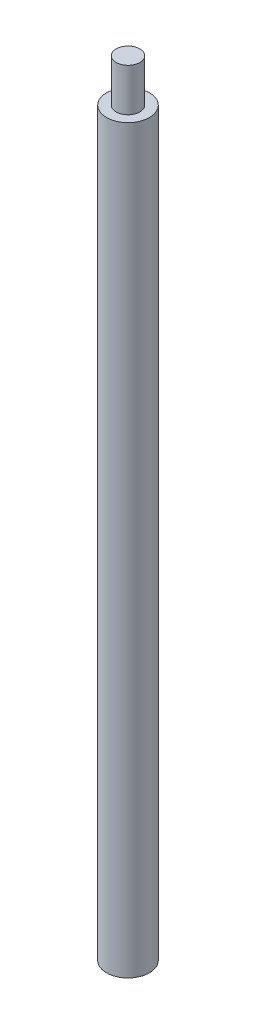
ISO-10303-21;
HEADER;
FILE_DESCRIPTION(('STEP AP214'),'2;1');
FILE_NAME('part.step','',(''),(''),'','','');
FILE_SCHEMA(('AUTOMOTIVE_DESIGN { 1 0 10303 214 1 1 1 1 }'));
ENDSEC;
DATA;
#1=APPLICATION_CONTEXT('core data for automotive mechanical design processes');
#2=APPLICATION_PROTOCOL_DEFINITION('international standard','automotive_design',2000,#1);
#3=PRODUCT_CONTEXT('',#1,'mechanical');
#4=PRODUCT('Part','Part','',(#3));
#5=PRODUCT_RELATED_PRODUCT_CATEGORY('part','',(#4));
#6=PRODUCT_DEFINITION_FORMATION('','',#4);
#7=PRODUCT_DEFINITION_CONTEXT('part definition',#1,'design');
#8=PRODUCT_DEFINITION('design','',#6,#7);
#9=PRODUCT_DEFINITION_SHAPE('','',#8);
#10=(LENGTH_UNIT() NAMED_UNIT(*) SI_UNIT(.MILLI.,.METRE.));
#11=(NAMED_UNIT(*) PLANE_ANGLE_UNIT() SI_UNIT($,.RADIAN.));
#12=(NAMED_UNIT(*) SI_UNIT($,.STERADIAN.) SOLID_ANGLE_UNIT());
#13=UNCERTAINTY_MEASURE_WITH_UNIT(LENGTH_MEASURE(1.E-05),#10,'distance_accuracy_value','');
#14=(GEOMETRIC_REPRESENTATION_CONTEXT(3) GLOBAL_UNCERTAINTY_ASSIGNED_CONTEXT((#13)) GLOBAL_UNIT_ASSIGNED_CONTEXT((#10,
#11,#12)) REPRESENTATION_CONTEXT('',''));
#15=CARTESIAN_POINT('',(0.,0.,0.));
#16=DIRECTION('',(0.,0.,1.));
#17=DIRECTION('',(1.,0.,0.));
#18=AXIS2_PLACEMENT_3D('',#15,#16,#17);
#19=CARTESIAN_POINT('',(0.,109.728,0.));
#20=DIRECTION('',(0.,-1.,0.));
#21=DIRECTION('',(0.,0.,-1.));
#22=AXIS2_PLACEMENT_3D('',#19,#20,#21);
#23=CYLINDRICAL_SURFACE('',#22,3.175);
#24=CARTESIAN_POINT('',(0.,109.728,0.));
#25=DIRECTION('',(0.,1.,0.));
#26=DIRECTION('',(0.,0.,1.));
#27=AXIS2_PLACEMENT_3D('',#24,#25,#26);
#28=CIRCLE('',#27,3.175);
#29=CARTESIAN_POINT('',(0.,109.728,3.175));
#30=VERTEX_POINT('',#29);
#31=EDGE_CURVE('E44',#30,#30,#28,.T.);
#32=ORIENTED_EDGE('',*,*,#31,.F.);
#33=EDGE_LOOP('',(#32));
#34=FACE_BOUND('',#33,.T.);
#35=CARTESIAN_POINT('',(0.,0.,0.));
#36=DIRECTION('',(0.,1.,0.));
#37=DIRECTION('',(0.,0.,1.));
#38=AXIS2_PLACEMENT_3D('',#35,#36,#37);
#39=CIRCLE('',#38,3.175);
#40=CARTESIAN_POINT('',(0.,0.,3.175));
#41=VERTEX_POINT('',#40);
#42=EDGE_CURVE('E40',#41,#41,#39,.T.);
#43=ORIENTED_EDGE('',*,*,#42,.T.);
#44=EDGE_LOOP('',(#43));
#45=FACE_BOUND('',#44,.T.);
#46=ADVANCED_FACE('F37',(#34,#45),#23,.T.);
#47=CARTESIAN_POINT('',(0.,109.728,0.));
#48=DIRECTION('',(0.,1.,0.));
#49=DIRECTION('',(0.,0.,1.));
#50=AXIS2_PLACEMENT_3D('',#47,#48,#49);
#51=PLANE('',#50);
#52=CARTESIAN_POINT('',(0.,109.728,0.));
#53=DIRECTION('',(0.,1.,0.));
#54=DIRECTION('',(0.,0.,1.));
#55=AXIS2_PLACEMENT_3D('',#52,#53,#54);
#56=CIRCLE('',#55,1.75259999999999);
#57=CARTESIAN_POINT('',(0.,109.728,1.75259999999999));
#58=VERTEX_POINT('',#57);
#59=EDGE_CURVE('E11',#58,#58,#56,.T.);
#60=ORIENTED_EDGE('',*,*,#59,.F.);
#61=EDGE_LOOP('',(#60));
#62=FACE_BOUND('',#61,.T.);
#63=ORIENTED_EDGE('',*,*,#31,.T.);
#64=EDGE_LOOP('',(#63));
#65=FACE_BOUND('',#64,.T.);
#66=ADVANCED_FACE('F68',(#62,#65),#51,.T.);
#67=CARTESIAN_POINT('',(0.,0.,0.));
#68=DIRECTION('',(0.,1.,0.));
#69=DIRECTION('',(0.,0.,1.));
#70=AXIS2_PLACEMENT_3D('',#67,#68,#69);
#71=PLANE('',#70);
#72=CARTESIAN_POINT('',(0.,0.,0.));
#73=DIRECTION('',(0.,-1.,0.));
#74=DIRECTION('',(0.,0.,-1.));
#75=AXIS2_PLACEMENT_3D('',#72,#73,#74);
#76=CIRCLE('',#75,1.75259999999999);
#77=CARTESIAN_POINT('',(0.,0.,-1.75259999999999));
#78=VERTEX_POINT('',#77);
#79=EDGE_CURVE('E105',#78,#78,#76,.T.);
#80=ORIENTED_EDGE('',*,*,#79,.F.);
#81=EDGE_LOOP('',(#80));
#82=FACE_BOUND('',#81,.T.);
#83=ORIENTED_EDGE('',*,*,#42,.F.);
#84=EDGE_LOOP('',(#83));
#85=FACE_BOUND('',#84,.T.);
#86=ADVANCED_FACE('F52',(#82,#85),#71,.F.);
#87=CARTESIAN_POINT('',(0.,9.39799999999999,0.));
#88=DIRECTION('',(0.,-1.,0.));
#89=DIRECTION('',(0.,0.,-1.));
#90=AXIS2_PLACEMENT_3D('',#87,#88,#89);
#91=CONICAL_SURFACE('',#90,1.35255,1.02974425867665);
#92=CARTESIAN_POINT('',(0.,10.2106940302657,0.));
#93=VERTEX_POINT('',#92);
#94=VERTEX_LOOP('',#93);
#95=FACE_BOUND('',#94,.T.);
#96=CARTESIAN_POINT('',(0.,9.39799999999999,0.));
#97=DIRECTION('',(0.,-1.,0.));
#98=DIRECTION('',(0.,0.,-1.));
#99=AXIS2_PLACEMENT_3D('',#96,#97,#98);
#100=CIRCLE('',#99,1.35255);
#101=CARTESIAN_POINT('',(0.,9.39799999999999,-1.35255));
#102=VERTEX_POINT('',#101);
#103=EDGE_CURVE('E56',#102,#102,#100,.T.);
#104=ORIENTED_EDGE('',*,*,#103,.T.);
#105=EDGE_LOOP('',(#104));
#106=FACE_BOUND('',#105,.T.);
#107=ADVANCED_FACE('F48',(#95,#106),#91,.F.);
#108=CARTESIAN_POINT('',(0.,0.,0.));
#109=DIRECTION('',(0.,-1.,0.));
#110=DIRECTION('',(0.,0.,-1.));
#111=AXIS2_PLACEMENT_3D('',#108,#109,#110);
#112=CYLINDRICAL_SURFACE('',#111,1.35255);
#113=ORIENTED_EDGE('',*,*,#103,.F.);
#114=EDGE_LOOP('',(#113));
#115=FACE_BOUND('',#114,.T.);
#116=CARTESIAN_POINT('',(0.,7.112,0.));
#117=DIRECTION('',(0.,-1.,0.));
#118=DIRECTION('',(0.,0.,-1.));
#119=AXIS2_PLACEMENT_3D('',#116,#117,#118);
#120=CIRCLE('',#119,1.35255);
#121=CARTESIAN_POINT('',(0.,7.112,-1.35255));
#122=VERTEX_POINT('',#121);
#123=EDGE_CURVE('E58',#122,#122,#120,.T.);
#124=ORIENTED_EDGE('',*,*,#123,.T.);
#125=EDGE_LOOP('',(#124));
#126=FACE_BOUND('',#125,.T.);
#127=ADVANCED_FACE('F51',(#115,#126),#112,.F.);
#128=CARTESIAN_POINT('',(1.35255,7.112,0.));
#129=DIRECTION('',(0.,1.,0.));
#130=DIRECTION('',(0.,0.,1.));
#131=AXIS2_PLACEMENT_3D('',#128,#129,#130);
#132=PLANE('',#131);
#133=ORIENTED_EDGE('',*,*,#123,.F.);
#134=EDGE_LOOP('',(#133));
#135=FACE_BOUND('',#134,.T.);
#136=CARTESIAN_POINT('',(0.,7.112,0.));
#137=DIRECTION('',(0.,-1.,0.));
#138=DIRECTION('',(0.,0.,-1.));
#139=AXIS2_PLACEMENT_3D('',#136,#137,#138);
#140=CIRCLE('',#139,1.7526);
#141=CARTESIAN_POINT('',(0.,7.112,-1.7526));
#142=VERTEX_POINT('',#141);
#143=EDGE_CURVE('E62',#142,#142,#140,.T.);
#144=ORIENTED_EDGE('',*,*,#143,.T.);
#145=EDGE_LOOP('',(#144));
#146=FACE_BOUND('',#145,.T.);
#147=ADVANCED_FACE('F85',(#135,#146),#132,.F.);
#148=CARTESIAN_POINT('',(0.,0.,0.));
#149=DIRECTION('',(0.,-1.,0.));
#150=DIRECTION('',(0.,0.,-1.));
#151=AXIS2_PLACEMENT_3D('',#148,#149,#150);
#152=CYLINDRICAL_SURFACE('',#151,1.75259999999999);
#153=ORIENTED_EDGE('',*,*,#143,.F.);
#154=EDGE_LOOP('',(#153));
#155=FACE_BOUND('',#154,.T.);
#156=ORIENTED_EDGE('',*,*,#79,.T.);
#157=EDGE_LOOP('',(#156));
#158=FACE_BOUND('',#157,.T.);
#159=ADVANCED_FACE('F88',(#155,#158),#152,.F.);
#160=CARTESIAN_POINT('',(0.,116.078,0.));
#161=DIRECTION('',(0.,-1.,0.));
#162=DIRECTION('',(0.,0.,-1.));
#163=AXIS2_PLACEMENT_3D('',#160,#161,#162);
#164=CYLINDRICAL_SURFACE('',#163,1.75259999999999);
#165=CARTESIAN_POINT('',(0.,116.078,0.));
#166=DIRECTION('',(0.,1.,0.));
#167=DIRECTION('',(0.,0.,1.));
#168=AXIS2_PLACEMENT_3D('',#165,#166,#167);
#169=CIRCLE('',#168,1.75259999999999);
#170=CARTESIAN_POINT('',(0.,116.078,1.75259999999999));
#171=VERTEX_POINT('',#170);
#172=EDGE_CURVE('E104',#171,#171,#169,.T.);
#173=ORIENTED_EDGE('',*,*,#172,.F.);
#174=EDGE_LOOP('',(#173));
#175=FACE_BOUND('',#174,.T.);
#176=ORIENTED_EDGE('',*,*,#59,.T.);
#177=EDGE_LOOP('',(#176));
#178=FACE_BOUND('',#177,.T.);
#179=ADVANCED_FACE('F92',(#175,#178),#164,.T.);
#180=CARTESIAN_POINT('',(0.,116.078,0.));
#181=DIRECTION('',(0.,1.,0.));
#182=DIRECTION('',(0.,0.,1.));
#183=AXIS2_PLACEMENT_3D('',#180,#181,#182);
#184=PLANE('',#183);
#185=ORIENTED_EDGE('',*,*,#172,.T.);
#186=EDGE_LOOP('',(#185));
#187=FACE_BOUND('',#186,.T.);
#188=ADVANCED_FACE('F96',(#187),#184,.T.);
#189=CLOSED_SHELL('',(#46,#66,#86,#107,#127,#147,#159,#179,#188));
#190=MANIFOLD_SOLID_BREP('B2',#189);
#191=ADVANCED_BREP_SHAPE_REPRESENTATION('',(#18,#190),#14);
#192=SHAPE_DEFINITION_REPRESENTATION(#9,#191);
ENDSEC;
END-ISO-10303-21;
